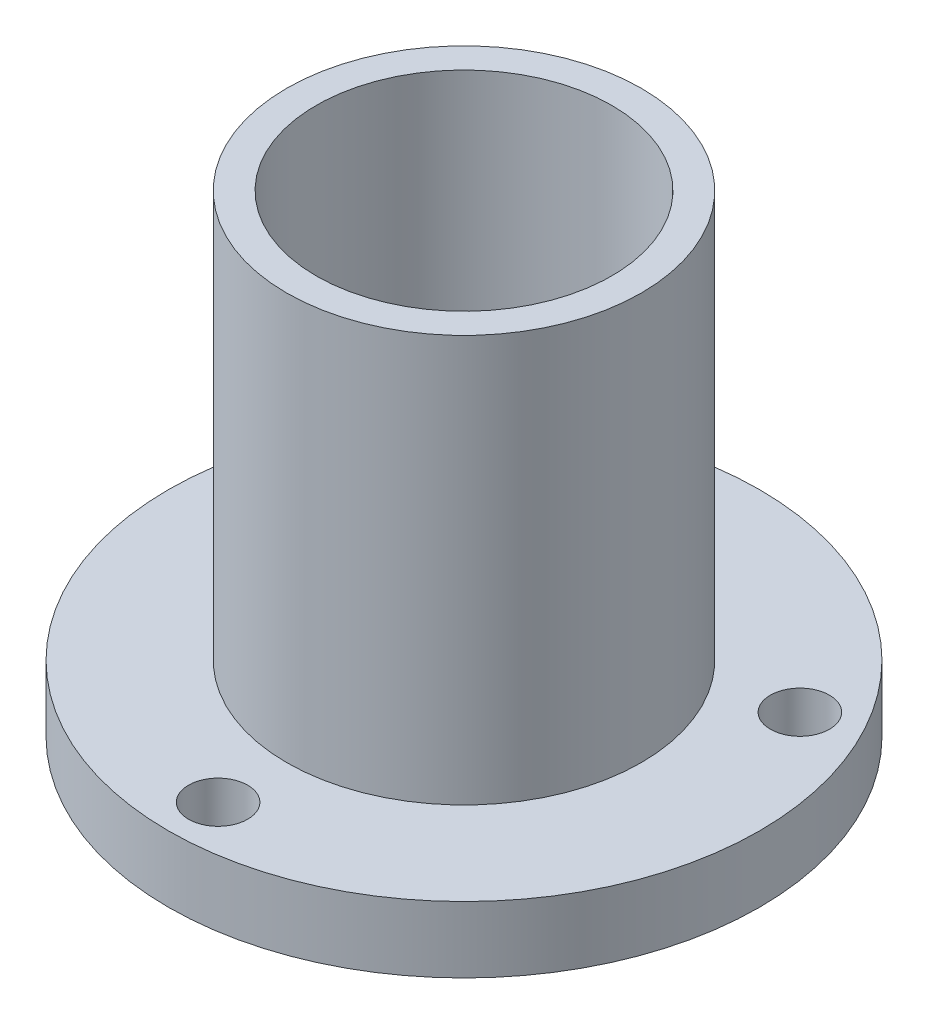
ISO-10303-21;
HEADER;
FILE_DESCRIPTION(('STEP AP214'),'2;1');
FILE_NAME('part.step','',(''),(''),'','','');
FILE_SCHEMA(('AUTOMOTIVE_DESIGN { 1 0 10303 214 1 1 1 1 }'));
ENDSEC;
DATA;
#1=APPLICATION_CONTEXT('core data for automotive mechanical design processes');
#2=APPLICATION_PROTOCOL_DEFINITION('international standard','automotive_design',2000,#1);
#3=PRODUCT_CONTEXT('',#1,'mechanical');
#4=PRODUCT('Part','Part','',(#3));
#5=PRODUCT_RELATED_PRODUCT_CATEGORY('part','',(#4));
#6=PRODUCT_DEFINITION_FORMATION('','',#4);
#7=PRODUCT_DEFINITION_CONTEXT('part definition',#1,'design');
#8=PRODUCT_DEFINITION('design','',#6,#7);
#9=PRODUCT_DEFINITION_SHAPE('','',#8);
#10=(LENGTH_UNIT() NAMED_UNIT(*) SI_UNIT(.MILLI.,.METRE.));
#11=(NAMED_UNIT(*) PLANE_ANGLE_UNIT() SI_UNIT($,.RADIAN.));
#12=(NAMED_UNIT(*) SI_UNIT($,.STERADIAN.) SOLID_ANGLE_UNIT());
#13=UNCERTAINTY_MEASURE_WITH_UNIT(LENGTH_MEASURE(1.E-05),#10,'distance_accuracy_value','');
#14=(GEOMETRIC_REPRESENTATION_CONTEXT(3) GLOBAL_UNCERTAINTY_ASSIGNED_CONTEXT((#13)) GLOBAL_UNIT_ASSIGNED_CONTEXT((#10,
#11,#12)) REPRESENTATION_CONTEXT('',''));
#15=CARTESIAN_POINT('',(0.,0.,0.));
#16=DIRECTION('',(0.,0.,1.));
#17=DIRECTION('',(1.,0.,0.));
#18=AXIS2_PLACEMENT_3D('',#15,#16,#17);
#19=CARTESIAN_POINT('',(0.,1.778,0.));
#20=DIRECTION('',(0.,-1.,0.));
#21=DIRECTION('',(0.,0.,-1.));
#22=AXIS2_PLACEMENT_3D('',#19,#20,#21);
#23=CYLINDRICAL_SURFACE('',#22,7.9375);
#24=CARTESIAN_POINT('',(0.,1.778,0.));
#25=DIRECTION('',(0.,1.,0.));
#26=DIRECTION('',(0.,0.,1.));
#27=AXIS2_PLACEMENT_3D('',#24,#25,#26);
#28=CIRCLE('',#27,7.9375);
#29=CARTESIAN_POINT('',(0.,1.778,7.9375));
#30=VERTEX_POINT('',#29);
#31=EDGE_CURVE('E38',#30,#30,#28,.T.);
#32=ORIENTED_EDGE('',*,*,#31,.F.);
#33=EDGE_LOOP('',(#32));
#34=FACE_BOUND('',#33,.T.);
#35=CARTESIAN_POINT('',(0.,0.,0.));
#36=DIRECTION('',(0.,1.,0.));
#37=DIRECTION('',(0.,0.,1.));
#38=AXIS2_PLACEMENT_3D('',#35,#36,#37);
#39=CIRCLE('',#38,7.9375);
#40=CARTESIAN_POINT('',(0.,0.,7.9375));
#41=VERTEX_POINT('',#40);
#42=EDGE_CURVE('E34',#41,#41,#39,.T.);
#43=ORIENTED_EDGE('',*,*,#42,.T.);
#44=EDGE_LOOP('',(#43));
#45=FACE_BOUND('',#44,.T.);
#46=ADVANCED_FACE('F31',(#34,#45),#23,.T.);
#47=CARTESIAN_POINT('',(0.,1.778,0.));
#48=DIRECTION('',(0.,1.,0.));
#49=DIRECTION('',(0.,0.,1.));
#50=AXIS2_PLACEMENT_3D('',#47,#48,#49);
#51=PLANE('',#50);
#52=CARTESIAN_POINT('',(0.,1.778,6.604));
#53=DIRECTION('',(0.,1.,0.));
#54=DIRECTION('',(0.,0.,1.));
#55=AXIS2_PLACEMENT_3D('',#52,#53,#54);
#56=CIRCLE('',#55,0.79375);
#57=CARTESIAN_POINT('',(0.,1.778,7.39775));
#58=VERTEX_POINT('',#57);
#59=EDGE_CURVE('E53',#58,#58,#56,.T.);
#60=ORIENTED_EDGE('',*,*,#59,.F.);
#61=EDGE_LOOP('',(#60));
#62=FACE_BOUND('',#61,.T.);
#63=CARTESIAN_POINT('',(5.7192317665927,1.778,-3.30199999999984));
#64=DIRECTION('',(0.,1.,0.));
#65=DIRECTION('',(0.,0.,1.));
#66=AXIS2_PLACEMENT_3D('',#63,#64,#65);
#67=CIRCLE('',#66,0.79375);
#68=CARTESIAN_POINT('',(5.7192317665927,1.778,-2.50824999999984));
#69=VERTEX_POINT('',#68);
#70=EDGE_CURVE('E56',#69,#69,#67,.T.);
#71=ORIENTED_EDGE('',*,*,#70,.F.);
#72=EDGE_LOOP('',(#71));
#73=FACE_BOUND('',#72,.T.);
#74=CARTESIAN_POINT('',(-5.71923176659216,1.778,-3.30200000000016));
#75=DIRECTION('',(0.,1.,0.));
#76=DIRECTION('',(0.,0.,1.));
#77=AXIS2_PLACEMENT_3D('',#74,#75,#76);
#78=CIRCLE('',#77,0.79375);
#79=CARTESIAN_POINT('',(-5.71923176659216,1.778,-2.50825000000016));
#80=VERTEX_POINT('',#79);
#81=EDGE_CURVE('E59',#80,#80,#78,.T.);
#82=ORIENTED_EDGE('',*,*,#81,.F.);
#83=EDGE_LOOP('',(#82));
#84=FACE_BOUND('',#83,.T.);
#85=CARTESIAN_POINT('',(0.,1.778,0.));
#86=DIRECTION('',(0.,1.,0.));
#87=DIRECTION('',(0.,0.,1.));
#88=AXIS2_PLACEMENT_3D('',#85,#86,#87);
#89=CIRCLE('',#88,4.7625);
#90=CARTESIAN_POINT('',(0.,1.778,4.7625));
#91=VERTEX_POINT('',#90);
#92=EDGE_CURVE('E10',#91,#91,#89,.T.);
#93=ORIENTED_EDGE('',*,*,#92,.F.);
#94=EDGE_LOOP('',(#93));
#95=FACE_BOUND('',#94,.T.);
#96=ORIENTED_EDGE('',*,*,#31,.T.);
#97=EDGE_LOOP('',(#96));
#98=FACE_BOUND('',#97,.T.);
#99=ADVANCED_FACE('F78',(#62,#73,#84,#95,#98),#51,.T.);
#100=CARTESIAN_POINT('',(0.,0.,0.));
#101=DIRECTION('',(0.,1.,0.));
#102=DIRECTION('',(0.,0.,1.));
#103=AXIS2_PLACEMENT_3D('',#100,#101,#102);
#104=PLANE('',#103);
#105=CARTESIAN_POINT('',(0.,0.,6.604));
#106=DIRECTION('',(0.,-1.,0.));
#107=DIRECTION('',(0.,0.,-1.));
#108=AXIS2_PLACEMENT_3D('',#105,#106,#107);
#109=CIRCLE('',#108,0.79375);
#110=CARTESIAN_POINT('',(0.,0.,5.81025));
#111=VERTEX_POINT('',#110);
#112=EDGE_CURVE('E62',#111,#111,#109,.T.);
#113=ORIENTED_EDGE('',*,*,#112,.F.);
#114=EDGE_LOOP('',(#113));
#115=FACE_BOUND('',#114,.T.);
#116=CARTESIAN_POINT('',(5.7192317665927,0.,-3.30199999999984));
#117=DIRECTION('',(0.,-1.,0.));
#118=DIRECTION('',(0.,0.,-1.));
#119=AXIS2_PLACEMENT_3D('',#116,#117,#118);
#120=CIRCLE('',#119,0.79375);
#121=CARTESIAN_POINT('',(5.7192317665927,0.,-4.09574999999984));
#122=VERTEX_POINT('',#121);
#123=EDGE_CURVE('E66',#122,#122,#120,.T.);
#124=ORIENTED_EDGE('',*,*,#123,.F.);
#125=EDGE_LOOP('',(#124));
#126=FACE_BOUND('',#125,.T.);
#127=CARTESIAN_POINT('',(-5.71923176659216,0.,-3.30200000000016));
#128=DIRECTION('',(0.,-1.,0.));
#129=DIRECTION('',(0.,0.,-1.));
#130=AXIS2_PLACEMENT_3D('',#127,#128,#129);
#131=CIRCLE('',#130,0.79375);
#132=CARTESIAN_POINT('',(-5.71923176659216,0.,-4.09575000000016));
#133=VERTEX_POINT('',#132);
#134=EDGE_CURVE('E63',#133,#133,#131,.T.);
#135=ORIENTED_EDGE('',*,*,#134,.F.);
#136=EDGE_LOOP('',(#135));
#137=FACE_BOUND('',#136,.T.);
#138=CARTESIAN_POINT('',(0.,0.,0.));
#139=DIRECTION('',(0.,1.,0.));
#140=DIRECTION('',(0.,0.,1.));
#141=AXIS2_PLACEMENT_3D('',#138,#139,#140);
#142=CIRCLE('',#141,3.96875);
#143=CARTESIAN_POINT('',(0.,0.,3.96875));
#144=VERTEX_POINT('',#143);
#145=EDGE_CURVE('E47',#144,#144,#142,.T.);
#146=ORIENTED_EDGE('',*,*,#145,.T.);
#147=EDGE_LOOP('',(#146));
#148=FACE_BOUND('',#147,.T.);
#149=ORIENTED_EDGE('',*,*,#42,.F.);
#150=EDGE_LOOP('',(#149));
#151=FACE_BOUND('',#150,.T.);
#152=ADVANCED_FACE('F74',(#115,#126,#137,#148,#151),#104,.F.);
#153=CARTESIAN_POINT('',(0.,12.7,0.));
#154=DIRECTION('',(0.,-1.,0.));
#155=DIRECTION('',(0.,0.,-1.));
#156=AXIS2_PLACEMENT_3D('',#153,#154,#155);
#157=CYLINDRICAL_SURFACE('',#156,4.7625);
#158=CARTESIAN_POINT('',(0.,12.7,0.));
#159=DIRECTION('',(0.,1.,0.));
#160=DIRECTION('',(0.,0.,1.));
#161=AXIS2_PLACEMENT_3D('',#158,#159,#160);
#162=CIRCLE('',#161,4.7625);
#163=CARTESIAN_POINT('',(0.,12.7,4.7625));
#164=VERTEX_POINT('',#163);
#165=EDGE_CURVE('E44',#164,#164,#162,.T.);
#166=ORIENTED_EDGE('',*,*,#165,.F.);
#167=EDGE_LOOP('',(#166));
#168=FACE_BOUND('',#167,.T.);
#169=ORIENTED_EDGE('',*,*,#92,.T.);
#170=EDGE_LOOP('',(#169));
#171=FACE_BOUND('',#170,.T.);
#172=ADVANCED_FACE('F77',(#168,#171),#157,.T.);
#173=CARTESIAN_POINT('',(0.,12.7,0.));
#174=DIRECTION('',(0.,1.,0.));
#175=DIRECTION('',(0.,0.,1.));
#176=AXIS2_PLACEMENT_3D('',#173,#174,#175);
#177=PLANE('',#176);
#178=CARTESIAN_POINT('',(0.,12.7,0.));
#179=DIRECTION('',(0.,-1.,0.));
#180=DIRECTION('',(0.,0.,-1.));
#181=AXIS2_PLACEMENT_3D('',#178,#179,#180);
#182=CIRCLE('',#181,3.96875);
#183=CARTESIAN_POINT('',(0.,12.7,-3.96875));
#184=VERTEX_POINT('',#183);
#185=EDGE_CURVE('E50',#184,#184,#182,.T.);
#186=ORIENTED_EDGE('',*,*,#185,.T.);
#187=EDGE_LOOP('',(#186));
#188=FACE_BOUND('',#187,.T.);
#189=ORIENTED_EDGE('',*,*,#165,.T.);
#190=EDGE_LOOP('',(#189));
#191=FACE_BOUND('',#190,.T.);
#192=ADVANCED_FACE('F104',(#188,#191),#177,.T.);
#193=CARTESIAN_POINT('',(0.,12.7,0.));
#194=DIRECTION('',(0.,-1.,0.));
#195=DIRECTION('',(0.,0.,-1.));
#196=AXIS2_PLACEMENT_3D('',#193,#194,#195);
#197=CYLINDRICAL_SURFACE('',#196,3.96875);
#198=ORIENTED_EDGE('',*,*,#185,.F.);
#199=EDGE_LOOP('',(#198));
#200=FACE_BOUND('',#199,.T.);
#201=ORIENTED_EDGE('',*,*,#145,.F.);
#202=EDGE_LOOP('',(#201));
#203=FACE_BOUND('',#202,.T.);
#204=ADVANCED_FACE('F108',(#200,#203),#197,.F.);
#205=CARTESIAN_POINT('',(-5.71923176659216,12.7,-3.30200000000016));
#206=DIRECTION('',(0.,-1.,0.));
#207=DIRECTION('',(0.,0.,-1.));
#208=AXIS2_PLACEMENT_3D('',#205,#206,#207);
#209=CYLINDRICAL_SURFACE('',#208,0.79375);
#210=ORIENTED_EDGE('',*,*,#81,.T.);
#211=EDGE_LOOP('',(#210));
#212=FACE_BOUND('',#211,.T.);
#213=ORIENTED_EDGE('',*,*,#134,.T.);
#214=EDGE_LOOP('',(#213));
#215=FACE_BOUND('',#214,.T.);
#216=ADVANCED_FACE('F112',(#212,#215),#209,.F.);
#217=CARTESIAN_POINT('',(5.7192317665927,12.7,-3.30199999999984));
#218=DIRECTION('',(0.,-1.,0.));
#219=DIRECTION('',(0.,0.,-1.));
#220=AXIS2_PLACEMENT_3D('',#217,#218,#219);
#221=CYLINDRICAL_SURFACE('',#220,0.79375);
#222=ORIENTED_EDGE('',*,*,#70,.T.);
#223=EDGE_LOOP('',(#222));
#224=FACE_BOUND('',#223,.T.);
#225=ORIENTED_EDGE('',*,*,#123,.T.);
#226=EDGE_LOOP('',(#225));
#227=FACE_BOUND('',#226,.T.);
#228=ADVANCED_FACE('F116',(#224,#227),#221,.F.);
#229=CARTESIAN_POINT('',(0.,12.7,6.604));
#230=DIRECTION('',(0.,-1.,0.));
#231=DIRECTION('',(0.,0.,-1.));
#232=AXIS2_PLACEMENT_3D('',#229,#230,#231);
#233=CYLINDRICAL_SURFACE('',#232,0.79375);
#234=ORIENTED_EDGE('',*,*,#59,.T.);
#235=EDGE_LOOP('',(#234));
#236=FACE_BOUND('',#235,.T.);
#237=ORIENTED_EDGE('',*,*,#112,.T.);
#238=EDGE_LOOP('',(#237));
#239=FACE_BOUND('',#238,.T.);
#240=ADVANCED_FACE('F72',(#236,#239),#233,.F.);
#241=CLOSED_SHELL('',(#46,#99,#152,#172,#192,#204,#216,#228,#240));
#242=MANIFOLD_SOLID_BREP('B2',#241);
#243=ADVANCED_BREP_SHAPE_REPRESENTATION('',(#18,#242),#14);
#244=SHAPE_DEFINITION_REPRESENTATION(#9,#243);
ENDSEC;
END-ISO-10303-21;
